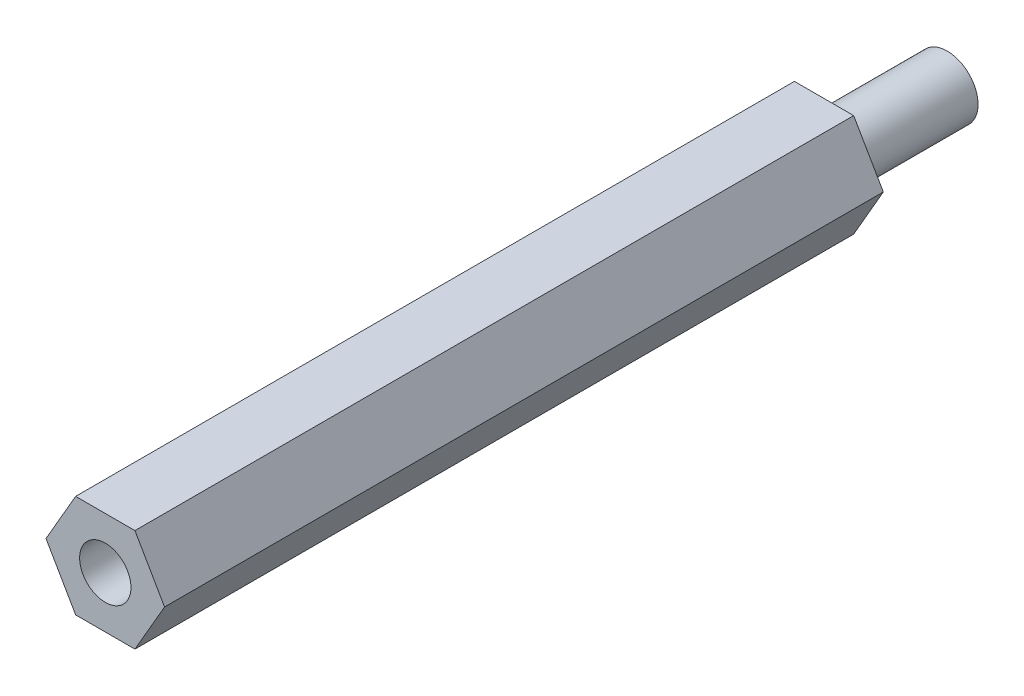
ISO-10303-21;
HEADER;
FILE_DESCRIPTION(('STEP AP214'),'2;1');
FILE_NAME('part.step','',(''),(''),'','','');
FILE_SCHEMA(('AUTOMOTIVE_DESIGN { 1 0 10303 214 1 1 1 1 }'));
ENDSEC;
DATA;
#1=APPLICATION_CONTEXT('core data for automotive mechanical design processes');
#2=APPLICATION_PROTOCOL_DEFINITION('international standard','automotive_design',2000,#1);
#3=PRODUCT_CONTEXT('',#1,'mechanical');
#4=PRODUCT('Part','Part','',(#3));
#5=PRODUCT_RELATED_PRODUCT_CATEGORY('part','',(#4));
#6=PRODUCT_DEFINITION_FORMATION('','',#4);
#7=PRODUCT_DEFINITION_CONTEXT('part definition',#1,'design');
#8=PRODUCT_DEFINITION('design','',#6,#7);
#9=PRODUCT_DEFINITION_SHAPE('','',#8);
#10=(LENGTH_UNIT() NAMED_UNIT(*) SI_UNIT(.MILLI.,.METRE.));
#11=(NAMED_UNIT(*) PLANE_ANGLE_UNIT() SI_UNIT($,.RADIAN.));
#12=(NAMED_UNIT(*) SI_UNIT($,.STERADIAN.) SOLID_ANGLE_UNIT());
#13=UNCERTAINTY_MEASURE_WITH_UNIT(LENGTH_MEASURE(1.E-05),#10,'distance_accuracy_value','');
#14=(GEOMETRIC_REPRESENTATION_CONTEXT(3) GLOBAL_UNCERTAINTY_ASSIGNED_CONTEXT((#13)) GLOBAL_UNIT_ASSIGNED_CONTEXT((#10,
#11,#12)) REPRESENTATION_CONTEXT('',''));
#15=CARTESIAN_POINT('',(0.,0.,0.));
#16=DIRECTION('',(0.,0.,1.));
#17=DIRECTION('',(1.,0.,0.));
#18=AXIS2_PLACEMENT_3D('',#15,#16,#17);
#19=CARTESIAN_POINT('',(1.44337567297406,2.5,35.));
#20=DIRECTION('',(0.,-1.,0.));
#21=DIRECTION('',(1.,0.,0.));
#22=AXIS2_PLACEMENT_3D('',#19,#20,#21);
#23=PLANE('',#22);
#24=DIRECTION('',(-1.,0.,0.));
#25=VECTOR('',#24,1.);
#26=CARTESIAN_POINT('',(1.44337567297406,2.5,0.));
#27=LINE('',#26,#25);
#28=CARTESIAN_POINT('',(1.44337567297406,2.5,0.));
#29=VERTEX_POINT('',#28);
#30=CARTESIAN_POINT('',(-1.44337567297407,2.5,0.));
#31=VERTEX_POINT('',#30);
#32=EDGE_CURVE('E121',#29,#31,#27,.T.);
#33=ORIENTED_EDGE('',*,*,#32,.T.);
#34=DIRECTION('',(0.,0.,-1.));
#35=VECTOR('',#34,1.);
#36=CARTESIAN_POINT('',(-1.44337567297407,2.5,35.));
#37=LINE('',#36,#35);
#38=CARTESIAN_POINT('',(-1.44337567297407,2.5,35.));
#39=VERTEX_POINT('',#38);
#40=EDGE_CURVE('E36',#39,#31,#37,.T.);
#41=ORIENTED_EDGE('',*,*,#40,.F.);
#42=DIRECTION('',(-1.,0.,0.));
#43=VECTOR('',#42,1.);
#44=CARTESIAN_POINT('',(1.44337567297406,2.5,35.));
#45=LINE('',#44,#43);
#46=CARTESIAN_POINT('',(1.44337567297406,2.5,35.));
#47=VERTEX_POINT('',#46);
#48=EDGE_CURVE('E132',#47,#39,#45,.T.);
#49=ORIENTED_EDGE('',*,*,#48,.F.);
#50=DIRECTION('',(0.,0.,-1.));
#51=VECTOR('',#50,1.);
#52=CARTESIAN_POINT('',(1.44337567297406,2.5,35.));
#53=LINE('',#52,#51);
#54=EDGE_CURVE('E117',#47,#29,#53,.T.);
#55=ORIENTED_EDGE('',*,*,#54,.T.);
#56=EDGE_LOOP('',(#33,#41,#49,#55));
#57=FACE_BOUND('',#56,.T.);
#58=ADVANCED_FACE('F33',(#57),#23,.F.);
#59=CARTESIAN_POINT('',(-1.44337567297407,2.5,35.));
#60=DIRECTION('',(0.866025403784439,-0.5,0.));
#61=DIRECTION('',(0.5,0.866025403784439,0.));
#62=AXIS2_PLACEMENT_3D('',#59,#60,#61);
#63=PLANE('',#62);
#64=DIRECTION('',(-0.5,-0.866025403784439,0.));
#65=VECTOR('',#64,1.);
#66=CARTESIAN_POINT('',(-1.44337567297407,2.5,0.));
#67=LINE('',#66,#65);
#68=CARTESIAN_POINT('',(-2.88675134594813,0.,0.));
#69=VERTEX_POINT('',#68);
#70=EDGE_CURVE('E124',#31,#69,#67,.T.);
#71=ORIENTED_EDGE('',*,*,#70,.T.);
#72=DIRECTION('',(0.,0.,-1.));
#73=VECTOR('',#72,1.);
#74=CARTESIAN_POINT('',(-2.88675134594813,0.,35.));
#75=LINE('',#74,#73);
#76=CARTESIAN_POINT('',(-2.88675134594813,0.,35.));
#77=VERTEX_POINT('',#76);
#78=EDGE_CURVE('E135',#77,#69,#75,.T.);
#79=ORIENTED_EDGE('',*,*,#78,.F.);
#80=DIRECTION('',(-0.5,-0.866025403784439,0.));
#81=VECTOR('',#80,1.);
#82=CARTESIAN_POINT('',(-1.44337567297407,2.5,35.));
#83=LINE('',#82,#81);
#84=EDGE_CURVE('E89',#39,#77,#83,.T.);
#85=ORIENTED_EDGE('',*,*,#84,.F.);
#86=ORIENTED_EDGE('',*,*,#40,.T.);
#87=EDGE_LOOP('',(#71,#79,#85,#86));
#88=FACE_BOUND('',#87,.T.);
#89=ADVANCED_FACE('F140',(#88),#63,.F.);
#90=CARTESIAN_POINT('',(-2.88675134594813,0.,35.));
#91=DIRECTION('',(0.866025403784438,0.5,0.));
#92=DIRECTION('',(-0.5,0.866025403784438,0.));
#93=AXIS2_PLACEMENT_3D('',#90,#91,#92);
#94=PLANE('',#93);
#95=DIRECTION('',(0.5,-0.866025403784438,0.));
#96=VECTOR('',#95,1.);
#97=CARTESIAN_POINT('',(-2.88675134594813,0.,0.));
#98=LINE('',#97,#96);
#99=CARTESIAN_POINT('',(-1.44337567297406,-2.5,0.));
#100=VERTEX_POINT('',#99);
#101=EDGE_CURVE('E127',#69,#100,#98,.T.);
#102=ORIENTED_EDGE('',*,*,#101,.T.);
#103=DIRECTION('',(0.,0.,-1.));
#104=VECTOR('',#103,1.);
#105=CARTESIAN_POINT('',(-1.44337567297406,-2.5,35.));
#106=LINE('',#105,#104);
#107=CARTESIAN_POINT('',(-1.44337567297406,-2.5,35.));
#108=VERTEX_POINT('',#107);
#109=EDGE_CURVE('E112',#108,#100,#106,.T.);
#110=ORIENTED_EDGE('',*,*,#109,.F.);
#111=DIRECTION('',(0.5,-0.866025403784438,0.));
#112=VECTOR('',#111,1.);
#113=CARTESIAN_POINT('',(-2.88675134594813,0.,35.));
#114=LINE('',#113,#112);
#115=EDGE_CURVE('E103',#77,#108,#114,.T.);
#116=ORIENTED_EDGE('',*,*,#115,.F.);
#117=ORIENTED_EDGE('',*,*,#78,.T.);
#118=EDGE_LOOP('',(#102,#110,#116,#117));
#119=FACE_BOUND('',#118,.T.);
#120=ADVANCED_FACE('F146',(#119),#94,.F.);
#121=CARTESIAN_POINT('',(-1.44337567297406,-2.5,35.));
#122=DIRECTION('',(0.,1.,0.));
#123=DIRECTION('',(-1.,0.,0.));
#124=AXIS2_PLACEMENT_3D('',#121,#122,#123);
#125=PLANE('',#124);
#126=DIRECTION('',(1.,0.,0.));
#127=VECTOR('',#126,1.);
#128=CARTESIAN_POINT('',(-1.44337567297406,-2.5,0.));
#129=LINE('',#128,#127);
#130=CARTESIAN_POINT('',(1.44337567297407,-2.5,0.));
#131=VERTEX_POINT('',#130);
#132=EDGE_CURVE('E111',#100,#131,#129,.T.);
#133=ORIENTED_EDGE('',*,*,#132,.T.);
#134=DIRECTION('',(0.,0.,-1.));
#135=VECTOR('',#134,1.);
#136=CARTESIAN_POINT('',(1.44337567297407,-2.5,35.));
#137=LINE('',#136,#135);
#138=CARTESIAN_POINT('',(1.44337567297407,-2.5,35.));
#139=VERTEX_POINT('',#138);
#140=EDGE_CURVE('E108',#139,#131,#137,.T.);
#141=ORIENTED_EDGE('',*,*,#140,.F.);
#142=DIRECTION('',(1.,0.,0.));
#143=VECTOR('',#142,1.);
#144=CARTESIAN_POINT('',(-1.44337567297406,-2.5,35.));
#145=LINE('',#144,#143);
#146=EDGE_CURVE('E97',#108,#139,#145,.T.);
#147=ORIENTED_EDGE('',*,*,#146,.F.);
#148=ORIENTED_EDGE('',*,*,#109,.T.);
#149=EDGE_LOOP('',(#133,#141,#147,#148));
#150=FACE_BOUND('',#149,.T.);
#151=ADVANCED_FACE('F109',(#150),#125,.F.);
#152=CARTESIAN_POINT('',(1.44337567297407,-2.5,35.));
#153=DIRECTION('',(-0.866025403784439,0.5,0.));
#154=DIRECTION('',(-0.5,-0.866025403784439,0.));
#155=AXIS2_PLACEMENT_3D('',#152,#153,#154);
#156=PLANE('',#155);
#157=DIRECTION('',(0.5,0.866025403784439,0.));
#158=VECTOR('',#157,1.);
#159=CARTESIAN_POINT('',(1.44337567297407,-2.5,0.));
#160=LINE('',#159,#158);
#161=CARTESIAN_POINT('',(2.88675134594813,0.,0.));
#162=VERTEX_POINT('',#161);
#163=EDGE_CURVE('E74',#131,#162,#160,.T.);
#164=ORIENTED_EDGE('',*,*,#163,.T.);
#165=DIRECTION('',(0.,0.,-1.));
#166=VECTOR('',#165,1.);
#167=CARTESIAN_POINT('',(2.88675134594813,0.,35.));
#168=LINE('',#167,#166);
#169=CARTESIAN_POINT('',(2.88675134594813,0.,35.));
#170=VERTEX_POINT('',#169);
#171=EDGE_CURVE('E113',#170,#162,#168,.T.);
#172=ORIENTED_EDGE('',*,*,#171,.F.);
#173=DIRECTION('',(0.5,0.866025403784439,0.));
#174=VECTOR('',#173,1.);
#175=CARTESIAN_POINT('',(1.44337567297407,-2.5,35.));
#176=LINE('',#175,#174);
#177=EDGE_CURVE('E101',#139,#170,#176,.T.);
#178=ORIENTED_EDGE('',*,*,#177,.F.);
#179=ORIENTED_EDGE('',*,*,#140,.T.);
#180=EDGE_LOOP('',(#164,#172,#178,#179));
#181=FACE_BOUND('',#180,.T.);
#182=ADVANCED_FACE('F115',(#181),#156,.F.);
#183=CARTESIAN_POINT('',(2.88675134594813,0.,35.));
#184=DIRECTION('',(-0.866025403784439,-0.5,0.));
#185=DIRECTION('',(0.5,-0.866025403784439,0.));
#186=AXIS2_PLACEMENT_3D('',#183,#184,#185);
#187=PLANE('',#186);
#188=DIRECTION('',(-0.5,0.866025403784439,0.));
#189=VECTOR('',#188,1.);
#190=CARTESIAN_POINT('',(2.88675134594813,0.,0.));
#191=LINE('',#190,#189);
#192=EDGE_CURVE('E80',#162,#29,#191,.T.);
#193=ORIENTED_EDGE('',*,*,#192,.T.);
#194=ORIENTED_EDGE('',*,*,#54,.F.);
#195=DIRECTION('',(-0.5,0.866025403784439,0.));
#196=VECTOR('',#195,1.);
#197=CARTESIAN_POINT('',(2.88675134594813,0.,35.));
#198=LINE('',#197,#196);
#199=EDGE_CURVE('E50',#170,#47,#198,.T.);
#200=ORIENTED_EDGE('',*,*,#199,.F.);
#201=ORIENTED_EDGE('',*,*,#171,.T.);
#202=EDGE_LOOP('',(#193,#194,#200,#201));
#203=FACE_BOUND('',#202,.T.);
#204=ADVANCED_FACE('F162',(#203),#187,.F.);
#205=CARTESIAN_POINT('',(0.,0.,35.));
#206=DIRECTION('',(0.,0.,1.));
#207=DIRECTION('',(1.,0.,0.));
#208=AXIS2_PLACEMENT_3D('',#205,#206,#207);
#209=PLANE('',#208);
#210=CARTESIAN_POINT('',(0.,0.,35.));
#211=DIRECTION('',(0.,0.,1.));
#212=DIRECTION('',(1.,0.,0.));
#213=AXIS2_PLACEMENT_3D('',#210,#211,#212);
#214=CIRCLE('',#213,1.24999999999999);
#215=CARTESIAN_POINT('',(1.24999999999999,0.,35.));
#216=VERTEX_POINT('',#215);
#217=EDGE_CURVE('E155',#216,#216,#214,.T.);
#218=ORIENTED_EDGE('',*,*,#217,.F.);
#219=EDGE_LOOP('',(#218));
#220=FACE_BOUND('',#219,.T.);
#221=ORIENTED_EDGE('',*,*,#48,.T.);
#222=ORIENTED_EDGE('',*,*,#84,.T.);
#223=ORIENTED_EDGE('',*,*,#115,.T.);
#224=ORIENTED_EDGE('',*,*,#146,.T.);
#225=ORIENTED_EDGE('',*,*,#177,.T.);
#226=ORIENTED_EDGE('',*,*,#199,.T.);
#227=EDGE_LOOP('',(#221,#222,#223,#224,#225,#226));
#228=FACE_BOUND('',#227,.T.);
#229=ADVANCED_FACE('F99',(#220,#228),#209,.T.);
#230=CARTESIAN_POINT('',(0.,0.,0.));
#231=DIRECTION('',(0.,0.,1.));
#232=DIRECTION('',(1.,0.,0.));
#233=AXIS2_PLACEMENT_3D('',#230,#231,#232);
#234=PLANE('',#233);
#235=CARTESIAN_POINT('',(0.,0.,0.));
#236=DIRECTION('',(0.,0.,-1.));
#237=DIRECTION('',(-1.,0.,0.));
#238=AXIS2_PLACEMENT_3D('',#235,#236,#237);
#239=CIRCLE('',#238,1.5);
#240=CARTESIAN_POINT('',(-1.5,0.,0.));
#241=VERTEX_POINT('',#240);
#242=EDGE_CURVE('E11',#241,#241,#239,.T.);
#243=ORIENTED_EDGE('',*,*,#242,.F.);
#244=EDGE_LOOP('',(#243));
#245=FACE_BOUND('',#244,.T.);
#246=ORIENTED_EDGE('',*,*,#32,.F.);
#247=ORIENTED_EDGE('',*,*,#192,.F.);
#248=ORIENTED_EDGE('',*,*,#163,.F.);
#249=ORIENTED_EDGE('',*,*,#132,.F.);
#250=ORIENTED_EDGE('',*,*,#101,.F.);
#251=ORIENTED_EDGE('',*,*,#70,.F.);
#252=EDGE_LOOP('',(#246,#247,#248,#249,#250,#251));
#253=FACE_BOUND('',#252,.T.);
#254=ADVANCED_FACE('F145',(#245,#253),#234,.F.);
#255=CARTESIAN_POINT('',(0.,0.,-6.));
#256=DIRECTION('',(0.,0.,1.));
#257=DIRECTION('',(1.,0.,0.));
#258=AXIS2_PLACEMENT_3D('',#255,#256,#257);
#259=CYLINDRICAL_SURFACE('',#258,1.5);
#260=CARTESIAN_POINT('',(0.,0.,-6.));
#261=DIRECTION('',(0.,0.,-1.));
#262=DIRECTION('',(-1.,0.,0.));
#263=AXIS2_PLACEMENT_3D('',#260,#261,#262);
#264=CIRCLE('',#263,1.5);
#265=CARTESIAN_POINT('',(-1.5,0.,-6.));
#266=VERTEX_POINT('',#265);
#267=EDGE_CURVE('E125',#266,#266,#264,.T.);
#268=ORIENTED_EDGE('',*,*,#267,.F.);
#269=EDGE_LOOP('',(#268));
#270=FACE_BOUND('',#269,.T.);
#271=ORIENTED_EDGE('',*,*,#242,.T.);
#272=EDGE_LOOP('',(#271));
#273=FACE_BOUND('',#272,.T.);
#274=ADVANCED_FACE('F168',(#270,#273),#259,.T.);
#275=CARTESIAN_POINT('',(0.,0.,-6.));
#276=DIRECTION('',(0.,0.,-1.));
#277=DIRECTION('',(-1.,0.,0.));
#278=AXIS2_PLACEMENT_3D('',#275,#276,#277);
#279=PLANE('',#278);
#280=ORIENTED_EDGE('',*,*,#267,.T.);
#281=EDGE_LOOP('',(#280));
#282=FACE_BOUND('',#281,.T.);
#283=ADVANCED_FACE('F209',(#282),#279,.T.);
#284=CARTESIAN_POINT('',(0.,0.,27.5));
#285=DIRECTION('',(0.,0.,1.));
#286=DIRECTION('',(1.,0.,0.));
#287=AXIS2_PLACEMENT_3D('',#284,#285,#286);
#288=CONICAL_SURFACE('',#287,1.25,1.02974425867665);
#289=CARTESIAN_POINT('',(0.,0.,26.7489242262156));
#290=VERTEX_POINT('',#289);
#291=VERTEX_LOOP('',#290);
#292=FACE_BOUND('',#291,.T.);
#293=CARTESIAN_POINT('',(0.,0.,27.5));
#294=DIRECTION('',(0.,0.,1.));
#295=DIRECTION('',(1.,0.,0.));
#296=AXIS2_PLACEMENT_3D('',#293,#294,#295);
#297=CIRCLE('',#296,1.25);
#298=CARTESIAN_POINT('',(1.25,0.,27.5));
#299=VERTEX_POINT('',#298);
#300=EDGE_CURVE('E152',#299,#299,#297,.T.);
#301=ORIENTED_EDGE('',*,*,#300,.T.);
#302=EDGE_LOOP('',(#301));
#303=FACE_BOUND('',#302,.T.);
#304=ADVANCED_FACE('F217',(#292,#303),#288,.F.);
#305=CARTESIAN_POINT('',(0.,0.,35.));
#306=DIRECTION('',(0.,0.,1.));
#307=DIRECTION('',(1.,0.,0.));
#308=AXIS2_PLACEMENT_3D('',#305,#306,#307);
#309=CYLINDRICAL_SURFACE('',#308,1.24999999999999);
#310=ORIENTED_EDGE('',*,*,#300,.F.);
#311=EDGE_LOOP('',(#310));
#312=FACE_BOUND('',#311,.T.);
#313=ORIENTED_EDGE('',*,*,#217,.T.);
#314=EDGE_LOOP('',(#313));
#315=FACE_BOUND('',#314,.T.);
#316=ADVANCED_FACE('F159',(#312,#315),#309,.F.);
#317=CLOSED_SHELL('',(#58,#89,#120,#151,#182,#204,#229,#254,#274,#283,#304,#316));
#318=MANIFOLD_SOLID_BREP('B2',#317);
#319=ADVANCED_BREP_SHAPE_REPRESENTATION('',(#18,#318),#14);
#320=SHAPE_DEFINITION_REPRESENTATION(#9,#319);
ENDSEC;
END-ISO-10303-21;
